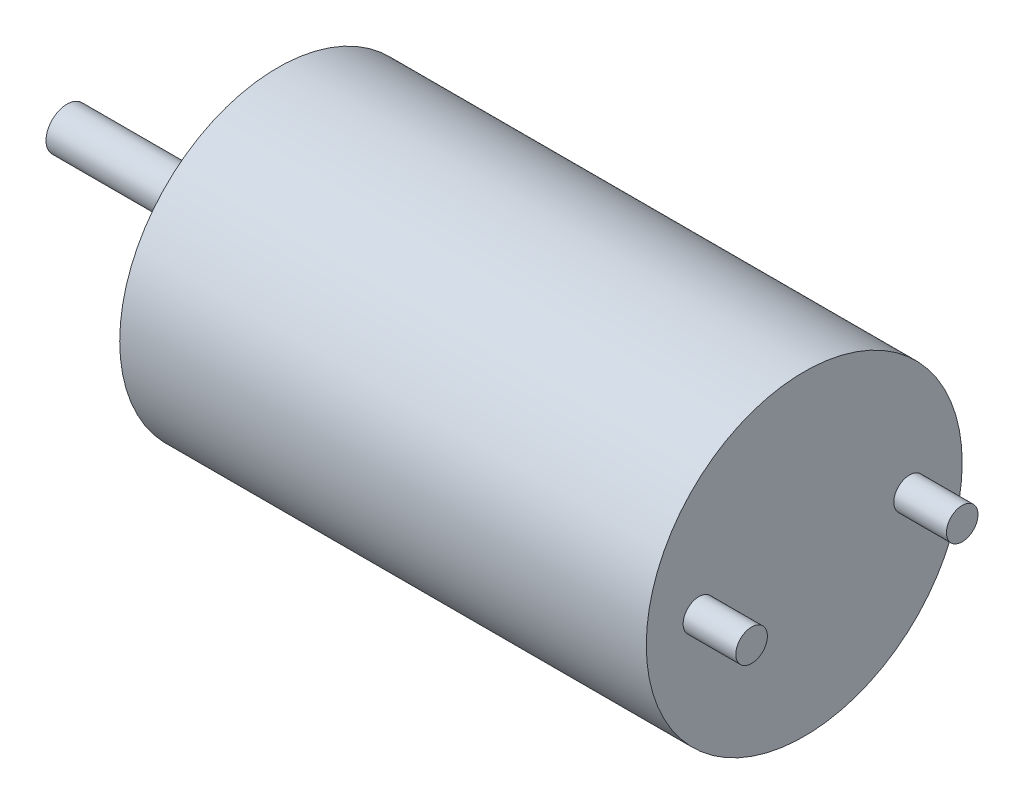
ISO-10303-21;
HEADER;
FILE_DESCRIPTION(('STEP AP214'),'2;1');
FILE_NAME('part.step','',(''),(''),'','','');
FILE_SCHEMA(('AUTOMOTIVE_DESIGN { 1 0 10303 214 1 1 1 1 }'));
ENDSEC;
DATA;
#1=APPLICATION_CONTEXT('core data for automotive mechanical design processes');
#2=APPLICATION_PROTOCOL_DEFINITION('international standard','automotive_design',2000,#1);
#3=PRODUCT_CONTEXT('',#1,'mechanical');
#4=PRODUCT('Part','Part','',(#3));
#5=PRODUCT_RELATED_PRODUCT_CATEGORY('part','',(#4));
#6=PRODUCT_DEFINITION_FORMATION('','',#4);
#7=PRODUCT_DEFINITION_CONTEXT('part definition',#1,'design');
#8=PRODUCT_DEFINITION('design','',#6,#7);
#9=PRODUCT_DEFINITION_SHAPE('','',#8);
#10=(LENGTH_UNIT() NAMED_UNIT(*) SI_UNIT(.MILLI.,.METRE.));
#11=(NAMED_UNIT(*) PLANE_ANGLE_UNIT() SI_UNIT($,.RADIAN.));
#12=(NAMED_UNIT(*) SI_UNIT($,.STERADIAN.) SOLID_ANGLE_UNIT());
#13=UNCERTAINTY_MEASURE_WITH_UNIT(LENGTH_MEASURE(1.E-05),#10,'distance_accuracy_value','');
#14=(GEOMETRIC_REPRESENTATION_CONTEXT(3) GLOBAL_UNCERTAINTY_ASSIGNED_CONTEXT((#13)) GLOBAL_UNIT_ASSIGNED_CONTEXT((#10,
#11,#12)) REPRESENTATION_CONTEXT('',''));
#15=CARTESIAN_POINT('',(0.,0.,0.));
#16=DIRECTION('',(0.,0.,1.));
#17=DIRECTION('',(1.,0.,0.));
#18=AXIS2_PLACEMENT_3D('',#15,#16,#17);
#19=CARTESIAN_POINT('',(10.,0.,0.));
#20=DIRECTION('',(-1.,0.,0.));
#21=DIRECTION('',(0.,0.,1.));
#22=AXIS2_PLACEMENT_3D('',#19,#20,#21);
#23=CYLINDRICAL_SURFACE('',#22,3.);
#24=CARTESIAN_POINT('',(10.,0.,0.));
#25=DIRECTION('',(1.,0.,0.));
#26=DIRECTION('',(0.,0.,-1.));
#27=AXIS2_PLACEMENT_3D('',#24,#25,#26);
#28=CIRCLE('',#27,3.);
#29=CARTESIAN_POINT('',(10.,0.,-3.));
#30=VERTEX_POINT('',#29);
#31=EDGE_CURVE('E47',#30,#30,#28,.T.);
#32=ORIENTED_EDGE('',*,*,#31,.F.);
#33=EDGE_LOOP('',(#32));
#34=FACE_BOUND('',#33,.T.);
#35=CARTESIAN_POINT('',(0.,0.,0.));
#36=DIRECTION('',(1.,0.,0.));
#37=DIRECTION('',(0.,0.,-1.));
#38=AXIS2_PLACEMENT_3D('',#35,#36,#37);
#39=CIRCLE('',#38,3.);
#40=CARTESIAN_POINT('',(0.,0.,-3.));
#41=VERTEX_POINT('',#40);
#42=EDGE_CURVE('E38',#41,#41,#39,.T.);
#43=ORIENTED_EDGE('',*,*,#42,.T.);
#44=EDGE_LOOP('',(#43));
#45=FACE_BOUND('',#44,.T.);
#46=ADVANCED_FACE('F35',(#34,#45),#23,.T.);
#47=CARTESIAN_POINT('',(10.,0.,0.));
#48=DIRECTION('',(1.,0.,0.));
#49=DIRECTION('',(0.,0.,-1.));
#50=AXIS2_PLACEMENT_3D('',#47,#48,#49);
#51=PLANE('',#50);
#52=CARTESIAN_POINT('',(10.,0.,-2.));
#53=DIRECTION('',(1.,0.,0.));
#54=DIRECTION('',(0.,0.,-1.));
#55=AXIS2_PLACEMENT_3D('',#52,#53,#54);
#56=CIRCLE('',#55,0.3);
#57=CARTESIAN_POINT('',(10.,0.,-2.3));
#58=VERTEX_POINT('',#57);
#59=EDGE_CURVE('E182',#58,#58,#56,.T.);
#60=ORIENTED_EDGE('',*,*,#59,.F.);
#61=EDGE_LOOP('',(#60));
#62=FACE_BOUND('',#61,.T.);
#63=CARTESIAN_POINT('',(10.,0.,2.));
#64=DIRECTION('',(1.,0.,0.));
#65=DIRECTION('',(0.,0.,-1.));
#66=AXIS2_PLACEMENT_3D('',#63,#64,#65);
#67=CIRCLE('',#66,0.3);
#68=CARTESIAN_POINT('',(10.,0.,1.7));
#69=VERTEX_POINT('',#68);
#70=EDGE_CURVE('E176',#69,#69,#67,.T.);
#71=ORIENTED_EDGE('',*,*,#70,.F.);
#72=EDGE_LOOP('',(#71));
#73=FACE_BOUND('',#72,.T.);
#74=ORIENTED_EDGE('',*,*,#31,.T.);
#75=EDGE_LOOP('',(#74));
#76=FACE_BOUND('',#75,.T.);
#77=ADVANCED_FACE('F65',(#62,#73,#76),#51,.T.);
#78=CARTESIAN_POINT('',(0.,0.,0.));
#79=DIRECTION('',(1.,0.,0.));
#80=DIRECTION('',(0.,0.,-1.));
#81=AXIS2_PLACEMENT_3D('',#78,#79,#80);
#82=PLANE('',#81);
#83=CARTESIAN_POINT('',(0.,0.,0.));
#84=DIRECTION('',(-1.,0.,0.));
#85=DIRECTION('',(0.,0.,1.));
#86=AXIS2_PLACEMENT_3D('',#83,#84,#85);
#87=CIRCLE('',#86,1.2);
#88=CARTESIAN_POINT('',(0.,0.,1.2));
#89=VERTEX_POINT('',#88);
#90=EDGE_CURVE('E42',#89,#89,#87,.T.);
#91=ORIENTED_EDGE('',*,*,#90,.F.);
#92=EDGE_LOOP('',(#91));
#93=FACE_BOUND('',#92,.T.);
#94=ORIENTED_EDGE('',*,*,#42,.F.);
#95=EDGE_LOOP('',(#94));
#96=FACE_BOUND('',#95,.T.);
#97=ADVANCED_FACE('F62',(#93,#96),#82,.F.);
#98=CARTESIAN_POINT('',(-0.8,0.,0.));
#99=DIRECTION('',(1.,0.,0.));
#100=DIRECTION('',(0.,0.,-1.));
#101=AXIS2_PLACEMENT_3D('',#98,#99,#100);
#102=CYLINDRICAL_SURFACE('',#101,1.2);
#103=CARTESIAN_POINT('',(-0.8,0.,0.));
#104=DIRECTION('',(-1.,0.,0.));
#105=DIRECTION('',(0.,0.,1.));
#106=AXIS2_PLACEMENT_3D('',#103,#104,#105);
#107=CIRCLE('',#106,1.2);
#108=CARTESIAN_POINT('',(-0.8,0.,1.2));
#109=VERTEX_POINT('',#108);
#110=EDGE_CURVE('E53',#109,#109,#107,.T.);
#111=ORIENTED_EDGE('',*,*,#110,.F.);
#112=EDGE_LOOP('',(#111));
#113=FACE_BOUND('',#112,.T.);
#114=ORIENTED_EDGE('',*,*,#90,.T.);
#115=EDGE_LOOP('',(#114));
#116=FACE_BOUND('',#115,.T.);
#117=ADVANCED_FACE('F64',(#113,#116),#102,.T.);
#118=CARTESIAN_POINT('',(-0.8,0.,0.));
#119=DIRECTION('',(-1.,0.,0.));
#120=DIRECTION('',(0.,0.,1.));
#121=AXIS2_PLACEMENT_3D('',#118,#119,#120);
#122=PLANE('',#121);
#123=CARTESIAN_POINT('',(-0.8,0.,0.));
#124=DIRECTION('',(-1.,0.,0.));
#125=DIRECTION('',(0.,0.,1.));
#126=AXIS2_PLACEMENT_3D('',#123,#124,#125);
#127=CIRCLE('',#126,0.4);
#128=CARTESIAN_POINT('',(-0.8,0.,0.4));
#129=VERTEX_POINT('',#128);
#130=EDGE_CURVE('E10',#129,#129,#127,.T.);
#131=ORIENTED_EDGE('',*,*,#130,.F.);
#132=EDGE_LOOP('',(#131));
#133=FACE_BOUND('',#132,.T.);
#134=ORIENTED_EDGE('',*,*,#110,.T.);
#135=EDGE_LOOP('',(#134));
#136=FACE_BOUND('',#135,.T.);
#137=ADVANCED_FACE('F71',(#133,#136),#122,.T.);
#138=CARTESIAN_POINT('',(-4.,0.,0.));
#139=DIRECTION('',(1.,0.,0.));
#140=DIRECTION('',(0.,0.,-1.));
#141=AXIS2_PLACEMENT_3D('',#138,#139,#140);
#142=CYLINDRICAL_SURFACE('',#141,0.4);
#143=CARTESIAN_POINT('',(-4.,0.,0.));
#144=DIRECTION('',(-1.,0.,0.));
#145=DIRECTION('',(0.,0.,1.));
#146=AXIS2_PLACEMENT_3D('',#143,#144,#145);
#147=CIRCLE('',#146,0.4);
#148=CARTESIAN_POINT('',(-4.,0.,0.4));
#149=VERTEX_POINT('',#148);
#150=EDGE_CURVE('E51',#149,#149,#147,.T.);
#151=ORIENTED_EDGE('',*,*,#150,.F.);
#152=EDGE_LOOP('',(#151));
#153=FACE_BOUND('',#152,.T.);
#154=ORIENTED_EDGE('',*,*,#130,.T.);
#155=EDGE_LOOP('',(#154));
#156=FACE_BOUND('',#155,.T.);
#157=ADVANCED_FACE('F139',(#153,#156),#142,.T.);
#158=CARTESIAN_POINT('',(-4.,0.,0.));
#159=DIRECTION('',(-1.,0.,0.));
#160=DIRECTION('',(0.,0.,1.));
#161=AXIS2_PLACEMENT_3D('',#158,#159,#160);
#162=PLANE('',#161);
#163=ORIENTED_EDGE('',*,*,#150,.T.);
#164=EDGE_LOOP('',(#163));
#165=FACE_BOUND('',#164,.T.);
#166=ADVANCED_FACE('F92',(#165),#162,.T.);
#167=CARTESIAN_POINT('',(11.,0.,2.));
#168=DIRECTION('',(-1.,0.,0.));
#169=DIRECTION('',(0.,0.,1.));
#170=AXIS2_PLACEMENT_3D('',#167,#168,#169);
#171=CYLINDRICAL_SURFACE('',#170,0.3);
#172=CARTESIAN_POINT('',(11.,0.,2.));
#173=DIRECTION('',(1.,0.,0.));
#174=DIRECTION('',(0.,0.,-1.));
#175=AXIS2_PLACEMENT_3D('',#172,#173,#174);
#176=CIRCLE('',#175,0.3);
#177=CARTESIAN_POINT('',(11.,0.,1.7));
#178=VERTEX_POINT('',#177);
#179=EDGE_CURVE('E174',#178,#178,#176,.T.);
#180=ORIENTED_EDGE('',*,*,#179,.F.);
#181=EDGE_LOOP('',(#180));
#182=FACE_BOUND('',#181,.T.);
#183=ORIENTED_EDGE('',*,*,#70,.T.);
#184=EDGE_LOOP('',(#183));
#185=FACE_BOUND('',#184,.T.);
#186=ADVANCED_FACE('F97',(#182,#185),#171,.T.);
#187=CARTESIAN_POINT('',(11.,0.,2.));
#188=DIRECTION('',(1.,0.,0.));
#189=DIRECTION('',(0.,0.,-1.));
#190=AXIS2_PLACEMENT_3D('',#187,#188,#189);
#191=PLANE('',#190);
#192=ORIENTED_EDGE('',*,*,#179,.T.);
#193=EDGE_LOOP('',(#192));
#194=FACE_BOUND('',#193,.T.);
#195=ADVANCED_FACE('F102',(#194),#191,.T.);
#196=CARTESIAN_POINT('',(11.,0.,-2.));
#197=DIRECTION('',(-1.,0.,0.));
#198=DIRECTION('',(0.,0.,1.));
#199=AXIS2_PLACEMENT_3D('',#196,#197,#198);
#200=CYLINDRICAL_SURFACE('',#199,0.3);
#201=CARTESIAN_POINT('',(11.,0.,-2.));
#202=DIRECTION('',(1.,0.,0.));
#203=DIRECTION('',(0.,0.,-1.));
#204=AXIS2_PLACEMENT_3D('',#201,#202,#203);
#205=CIRCLE('',#204,0.3);
#206=CARTESIAN_POINT('',(11.,0.,-2.3));
#207=VERTEX_POINT('',#206);
#208=EDGE_CURVE('E180',#207,#207,#205,.T.);
#209=ORIENTED_EDGE('',*,*,#208,.F.);
#210=EDGE_LOOP('',(#209));
#211=FACE_BOUND('',#210,.T.);
#212=ORIENTED_EDGE('',*,*,#59,.T.);
#213=EDGE_LOOP('',(#212));
#214=FACE_BOUND('',#213,.T.);
#215=ADVANCED_FACE('F112',(#211,#214),#200,.T.);
#216=CARTESIAN_POINT('',(11.,0.,-2.));
#217=DIRECTION('',(1.,0.,0.));
#218=DIRECTION('',(0.,0.,-1.));
#219=AXIS2_PLACEMENT_3D('',#216,#217,#218);
#220=PLANE('',#219);
#221=ORIENTED_EDGE('',*,*,#208,.T.);
#222=EDGE_LOOP('',(#221));
#223=FACE_BOUND('',#222,.T.);
#224=ADVANCED_FACE('F122',(#223),#220,.T.);
#225=CLOSED_SHELL('',(#46,#77,#97,#117,#137,#157,#166,#186,#195,#215,#224));
#226=MANIFOLD_SOLID_BREP('B2',#225);
#227=ADVANCED_BREP_SHAPE_REPRESENTATION('',(#18,#226),#14);
#228=SHAPE_DEFINITION_REPRESENTATION(#9,#227);
ENDSEC;
END-ISO-10303-21;
